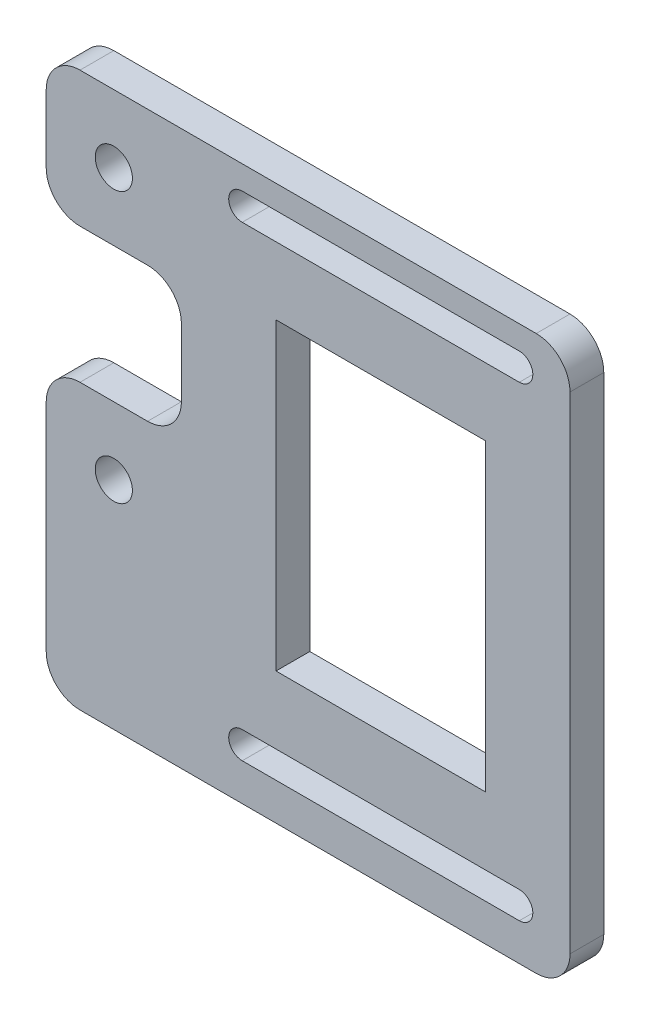
ISO-10303-21;
HEADER;
FILE_DESCRIPTION(('STEP AP214'),'2;1');
FILE_NAME('part.step','',(''),(''),'','','');
FILE_SCHEMA(('AUTOMOTIVE_DESIGN { 1 0 10303 214 1 1 1 1 }'));
ENDSEC;
DATA;
#1=APPLICATION_CONTEXT('core data for automotive mechanical design processes');
#2=APPLICATION_PROTOCOL_DEFINITION('international standard','automotive_design',2000,#1);
#3=PRODUCT_CONTEXT('',#1,'mechanical');
#4=PRODUCT('Part','Part','',(#3));
#5=PRODUCT_RELATED_PRODUCT_CATEGORY('part','',(#4));
#6=PRODUCT_DEFINITION_FORMATION('','',#4);
#7=PRODUCT_DEFINITION_CONTEXT('part definition',#1,'design');
#8=PRODUCT_DEFINITION('design','',#6,#7);
#9=PRODUCT_DEFINITION_SHAPE('','',#8);
#10=(LENGTH_UNIT() NAMED_UNIT(*) SI_UNIT(.MILLI.,.METRE.));
#11=(NAMED_UNIT(*) PLANE_ANGLE_UNIT() SI_UNIT($,.RADIAN.));
#12=(NAMED_UNIT(*) SI_UNIT($,.STERADIAN.) SOLID_ANGLE_UNIT());
#13=UNCERTAINTY_MEASURE_WITH_UNIT(LENGTH_MEASURE(1.E-05),#10,'distance_accuracy_value','');
#14=(GEOMETRIC_REPRESENTATION_CONTEXT(3) GLOBAL_UNCERTAINTY_ASSIGNED_CONTEXT((#13)) GLOBAL_UNIT_ASSIGNED_CONTEXT((#10,
#11,#12)) REPRESENTATION_CONTEXT('',''));
#15=CARTESIAN_POINT('',(0.,0.,0.));
#16=DIRECTION('',(0.,0.,1.));
#17=DIRECTION('',(1.,0.,0.));
#18=AXIS2_PLACEMENT_3D('',#15,#16,#17);
#19=CARTESIAN_POINT('',(0.,0.,5.));
#20=DIRECTION('',(0.,0.,1.));
#21=DIRECTION('',(1.,0.,0.));
#22=AXIS2_PLACEMENT_3D('',#19,#20,#21);
#23=PLANE('',#22);
#24=CARTESIAN_POINT('',(0.,20.,5.));
#25=DIRECTION('',(0.,0.,1.));
#26=DIRECTION('',(1.,0.,0.));
#27=AXIS2_PLACEMENT_3D('',#24,#25,#26);
#28=CIRCLE('',#27,2.75);
#29=CARTESIAN_POINT('',(2.75,20.,5.));
#30=VERTEX_POINT('',#29);
#31=EDGE_CURVE('E819',#30,#30,#28,.T.);
#32=ORIENTED_EDGE('',*,*,#31,.F.);
#33=EDGE_LOOP('',(#32));
#34=FACE_BOUND('',#33,.T.);
#35=CARTESIAN_POINT('',(0.,-20.,5.));
#36=DIRECTION('',(0.,0.,1.));
#37=DIRECTION('',(1.,0.,0.));
#38=AXIS2_PLACEMENT_3D('',#35,#36,#37);
#39=CIRCLE('',#38,2.75);
#40=CARTESIAN_POINT('',(2.75,-20.,5.));
#41=VERTEX_POINT('',#40);
#42=EDGE_CURVE('E815',#41,#41,#39,.T.);
#43=ORIENTED_EDGE('',*,*,#42,.F.);
#44=EDGE_LOOP('',(#43));
#45=FACE_BOUND('',#44,.T.);
#46=DIRECTION('',(0.,1.,0.));
#47=VECTOR('',#46,1.);
#48=CARTESIAN_POINT('',(67.5,-51.9999999999999,5.));
#49=LINE('',#48,#47);
#50=CARTESIAN_POINT('',(67.5,-46.9999999999999,5.));
#51=VERTEX_POINT('',#50);
#52=CARTESIAN_POINT('',(67.5,25.,5.));
#53=VERTEX_POINT('',#52);
#54=EDGE_CURVE('E345',#51,#53,#49,.T.);
#55=ORIENTED_EDGE('',*,*,#54,.T.);
#56=CARTESIAN_POINT('',(62.5,25.,5.));
#57=DIRECTION('',(0.,0.,1.));
#58=DIRECTION('',(1.,0.,0.));
#59=AXIS2_PLACEMENT_3D('',#56,#57,#58);
#60=CIRCLE('',#59,5.);
#61=CARTESIAN_POINT('',(62.5,30.,5.));
#62=VERTEX_POINT('',#61);
#63=EDGE_CURVE('E400',#53,#62,#60,.T.);
#64=ORIENTED_EDGE('',*,*,#63,.T.);
#65=DIRECTION('',(-1.,0.,0.));
#66=VECTOR('',#65,1.);
#67=CARTESIAN_POINT('',(67.5,30.,5.));
#68=LINE('',#67,#66);
#69=CARTESIAN_POINT('',(-5.,30.,5.));
#70=VERTEX_POINT('',#69);
#71=EDGE_CURVE('E325',#62,#70,#68,.T.);
#72=ORIENTED_EDGE('',*,*,#71,.T.);
#73=CARTESIAN_POINT('',(-5.,25.,5.));
#74=DIRECTION('',(0.,0.,1.));
#75=DIRECTION('',(1.,0.,0.));
#76=AXIS2_PLACEMENT_3D('',#73,#74,#75);
#77=CIRCLE('',#76,5.);
#78=CARTESIAN_POINT('',(-10.,25.,5.));
#79=VERTEX_POINT('',#78);
#80=EDGE_CURVE('E391',#70,#79,#77,.T.);
#81=ORIENTED_EDGE('',*,*,#80,.T.);
#82=DIRECTION('',(0.,-1.,0.));
#83=VECTOR('',#82,1.);
#84=CARTESIAN_POINT('',(-10.,30.,5.));
#85=LINE('',#84,#83);
#86=CARTESIAN_POINT('',(-10.,15.,5.));
#87=VERTEX_POINT('',#86);
#88=EDGE_CURVE('E328',#79,#87,#85,.T.);
#89=ORIENTED_EDGE('',*,*,#88,.T.);
#90=CARTESIAN_POINT('',(-5.,15.,5.));
#91=DIRECTION('',(0.,0.,1.));
#92=DIRECTION('',(1.,0.,0.));
#93=AXIS2_PLACEMENT_3D('',#90,#91,#92);
#94=CIRCLE('',#93,5.);
#95=CARTESIAN_POINT('',(-5.,10.,5.));
#96=VERTEX_POINT('',#95);
#97=EDGE_CURVE('E393',#87,#96,#94,.T.);
#98=ORIENTED_EDGE('',*,*,#97,.T.);
#99=DIRECTION('',(1.,0.,0.));
#100=VECTOR('',#99,1.);
#101=CARTESIAN_POINT('',(-10.,10.,5.));
#102=LINE('',#101,#100);
#103=CARTESIAN_POINT('',(5.,10.,5.));
#104=VERTEX_POINT('',#103);
#105=EDGE_CURVE('E332',#96,#104,#102,.T.);
#106=ORIENTED_EDGE('',*,*,#105,.T.);
#107=CARTESIAN_POINT('',(5.,5.,5.));
#108=DIRECTION('',(0.,0.,1.));
#109=DIRECTION('',(1.,0.,0.));
#110=AXIS2_PLACEMENT_3D('',#107,#108,#109);
#111=CIRCLE('',#110,5.);
#112=CARTESIAN_POINT('',(10.,5.,5.));
#113=VERTEX_POINT('',#112);
#114=EDGE_CURVE('E11',#104,#113,#111,.F.);
#115=ORIENTED_EDGE('',*,*,#114,.T.);
#116=DIRECTION('',(0.,-1.,0.));
#117=VECTOR('',#116,1.);
#118=CARTESIAN_POINT('',(10.,10.,5.));
#119=LINE('',#118,#117);
#120=CARTESIAN_POINT('',(10.,-5.,5.));
#121=VERTEX_POINT('',#120);
#122=EDGE_CURVE('E335',#113,#121,#119,.T.);
#123=ORIENTED_EDGE('',*,*,#122,.T.);
#124=CARTESIAN_POINT('',(5.,-5.,5.));
#125=DIRECTION('',(0.,0.,1.));
#126=DIRECTION('',(1.,0.,0.));
#127=AXIS2_PLACEMENT_3D('',#124,#125,#126);
#128=CIRCLE('',#127,5.);
#129=CARTESIAN_POINT('',(5.,-10.,5.));
#130=VERTEX_POINT('',#129);
#131=EDGE_CURVE('E433',#121,#130,#128,.F.);
#132=ORIENTED_EDGE('',*,*,#131,.T.);
#133=DIRECTION('',(-1.,0.,0.));
#134=VECTOR('',#133,1.);
#135=CARTESIAN_POINT('',(10.,-10.,5.));
#136=LINE('',#135,#134);
#137=CARTESIAN_POINT('',(-5.,-10.,5.));
#138=VERTEX_POINT('',#137);
#139=EDGE_CURVE('E338',#130,#138,#136,.T.);
#140=ORIENTED_EDGE('',*,*,#139,.T.);
#141=CARTESIAN_POINT('',(-5.,-15.,5.));
#142=DIRECTION('',(0.,0.,1.));
#143=DIRECTION('',(1.,0.,0.));
#144=AXIS2_PLACEMENT_3D('',#141,#142,#143);
#145=CIRCLE('',#144,5.);
#146=CARTESIAN_POINT('',(-10.,-15.,5.));
#147=VERTEX_POINT('',#146);
#148=EDGE_CURVE('E395',#138,#147,#145,.T.);
#149=ORIENTED_EDGE('',*,*,#148,.T.);
#150=DIRECTION('',(0.,-1.,0.));
#151=VECTOR('',#150,1.);
#152=CARTESIAN_POINT('',(-10.,-10.,5.));
#153=LINE('',#152,#151);
#154=CARTESIAN_POINT('',(-9.99999999999999,-46.9999999999999,5.));
#155=VERTEX_POINT('',#154);
#156=EDGE_CURVE('E341',#147,#155,#153,.T.);
#157=ORIENTED_EDGE('',*,*,#156,.T.);
#158=CARTESIAN_POINT('',(-4.99999999999999,-46.9999999999999,5.));
#159=DIRECTION('',(0.,0.,1.));
#160=DIRECTION('',(1.,0.,0.));
#161=AXIS2_PLACEMENT_3D('',#158,#159,#160);
#162=CIRCLE('',#161,5.);
#163=CARTESIAN_POINT('',(-4.99999999999999,-51.9999999999999,5.));
#164=VERTEX_POINT('',#163);
#165=EDGE_CURVE('E55',#155,#164,#162,.T.);
#166=ORIENTED_EDGE('',*,*,#165,.T.);
#167=DIRECTION('',(1.,0.,0.));
#168=VECTOR('',#167,1.);
#169=CARTESIAN_POINT('',(-9.99999999999999,-51.9999999999999,5.));
#170=LINE('',#169,#168);
#171=CARTESIAN_POINT('',(62.5,-51.9999999999999,5.));
#172=VERTEX_POINT('',#171);
#173=EDGE_CURVE('E343',#164,#172,#170,.T.);
#174=ORIENTED_EDGE('',*,*,#173,.T.);
#175=CARTESIAN_POINT('',(62.5,-46.9999999999999,5.));
#176=DIRECTION('',(0.,0.,1.));
#177=DIRECTION('',(1.,0.,0.));
#178=AXIS2_PLACEMENT_3D('',#175,#176,#177);
#179=CIRCLE('',#178,5.);
#180=EDGE_CURVE('E398',#172,#51,#179,.T.);
#181=ORIENTED_EDGE('',*,*,#180,.T.);
#182=EDGE_LOOP('',(#55,#64,#72,#81,#89,#98,#106,#115,#123,#132,#140,#149,#157,#166,#174,#181));
#183=FACE_BOUND('',#182,.T.);
#184=DIRECTION('',(1.,0.,0.));
#185=VECTOR('',#184,1.);
#186=CARTESIAN_POINT('',(19.,22.5,5.));
#187=LINE('',#186,#185);
#188=CARTESIAN_POINT('',(19.,22.5,5.));
#189=VERTEX_POINT('',#188);
#190=CARTESIAN_POINT('',(60.,22.4999999999999,5.));
#191=VERTEX_POINT('',#190);
#192=EDGE_CURVE('E296',#189,#191,#187,.T.);
#193=ORIENTED_EDGE('',*,*,#192,.F.);
#194=CARTESIAN_POINT('',(19.,24.4999999999999,5.));
#195=DIRECTION('',(0.,0.,1.));
#196=DIRECTION('',(1.,0.,0.));
#197=AXIS2_PLACEMENT_3D('',#194,#195,#196);
#198=CIRCLE('',#197,1.99999999999995);
#199=CARTESIAN_POINT('',(19.,26.4999999999999,5.));
#200=VERTEX_POINT('',#199);
#201=EDGE_CURVE('E294',#200,#189,#198,.T.);
#202=ORIENTED_EDGE('',*,*,#201,.F.);
#203=DIRECTION('',(-1.,0.,0.));
#204=VECTOR('',#203,1.);
#205=CARTESIAN_POINT('',(19.,26.4999999999999,5.));
#206=LINE('',#205,#204);
#207=CARTESIAN_POINT('',(60.,26.4999999999999,5.));
#208=VERTEX_POINT('',#207);
#209=EDGE_CURVE('E302',#208,#200,#206,.T.);
#210=ORIENTED_EDGE('',*,*,#209,.F.);
#211=CARTESIAN_POINT('',(60.,24.4999999999999,5.));
#212=DIRECTION('',(0.,0.,1.));
#213=DIRECTION('',(1.,0.,0.));
#214=AXIS2_PLACEMENT_3D('',#211,#212,#213);
#215=CIRCLE('',#214,1.99999999999995);
#216=EDGE_CURVE('E299',#191,#208,#215,.T.);
#217=ORIENTED_EDGE('',*,*,#216,.F.);
#218=EDGE_LOOP('',(#193,#202,#210,#217));
#219=FACE_BOUND('',#218,.T.);
#220=DIRECTION('',(1.,0.,0.));
#221=VECTOR('',#220,1.);
#222=CARTESIAN_POINT('',(19.,-46.4999999999999,5.));
#223=LINE('',#222,#221);
#224=CARTESIAN_POINT('',(19.,-46.4999999999999,5.));
#225=VERTEX_POINT('',#224);
#226=CARTESIAN_POINT('',(60.,-46.4999999999999,5.));
#227=VERTEX_POINT('',#226);
#228=EDGE_CURVE('E265',#225,#227,#223,.T.);
#229=ORIENTED_EDGE('',*,*,#228,.F.);
#230=CARTESIAN_POINT('',(19.,-44.4999999999999,5.));
#231=DIRECTION('',(0.,0.,1.));
#232=DIRECTION('',(1.,0.,0.));
#233=AXIS2_PLACEMENT_3D('',#230,#231,#232);
#234=CIRCLE('',#233,1.99999999999995);
#235=CARTESIAN_POINT('',(19.,-42.5,5.));
#236=VERTEX_POINT('',#235);
#237=EDGE_CURVE('E263',#236,#225,#234,.T.);
#238=ORIENTED_EDGE('',*,*,#237,.F.);
#239=DIRECTION('',(-1.,0.,0.));
#240=VECTOR('',#239,1.);
#241=CARTESIAN_POINT('',(19.,-42.5,5.));
#242=LINE('',#241,#240);
#243=CARTESIAN_POINT('',(60.,-42.5,5.));
#244=VERTEX_POINT('',#243);
#245=EDGE_CURVE('E271',#244,#236,#242,.T.);
#246=ORIENTED_EDGE('',*,*,#245,.F.);
#247=CARTESIAN_POINT('',(60.,-44.4999999999999,5.));
#248=DIRECTION('',(0.,0.,1.));
#249=DIRECTION('',(1.,0.,0.));
#250=AXIS2_PLACEMENT_3D('',#247,#248,#249);
#251=CIRCLE('',#250,1.99999999999995);
#252=EDGE_CURVE('E268',#227,#244,#251,.T.);
#253=ORIENTED_EDGE('',*,*,#252,.F.);
#254=EDGE_LOOP('',(#229,#238,#246,#253));
#255=FACE_BOUND('',#254,.T.);
#256=DIRECTION('',(1.,0.,0.));
#257=VECTOR('',#256,1.);
#258=CARTESIAN_POINT('',(24.,-32.5,5.));
#259=LINE('',#258,#257);
#260=CARTESIAN_POINT('',(24.,-32.5,5.));
#261=VERTEX_POINT('',#260);
#262=CARTESIAN_POINT('',(55.,-32.5,5.));
#263=VERTEX_POINT('',#262);
#264=EDGE_CURVE('E230',#261,#263,#259,.T.);
#265=ORIENTED_EDGE('',*,*,#264,.F.);
#266=DIRECTION('',(0.,-1.,0.));
#267=VECTOR('',#266,1.);
#268=CARTESIAN_POINT('',(24.,12.5,5.));
#269=LINE('',#268,#267);
#270=CARTESIAN_POINT('',(24.,12.5,5.));
#271=VERTEX_POINT('',#270);
#272=EDGE_CURVE('E220',#271,#261,#269,.T.);
#273=ORIENTED_EDGE('',*,*,#272,.F.);
#274=DIRECTION('',(-1.,0.,0.));
#275=VECTOR('',#274,1.);
#276=CARTESIAN_POINT('',(24.,12.5,5.));
#277=LINE('',#276,#275);
#278=CARTESIAN_POINT('',(55.,12.5,5.));
#279=VERTEX_POINT('',#278);
#280=EDGE_CURVE('E245',#279,#271,#277,.T.);
#281=ORIENTED_EDGE('',*,*,#280,.F.);
#282=DIRECTION('',(0.,1.,0.));
#283=VECTOR('',#282,1.);
#284=CARTESIAN_POINT('',(55.,12.5,5.));
#285=LINE('',#284,#283);
#286=EDGE_CURVE('E243',#263,#279,#285,.T.);
#287=ORIENTED_EDGE('',*,*,#286,.F.);
#288=EDGE_LOOP('',(#265,#273,#281,#287));
#289=FACE_BOUND('',#288,.T.);
#290=ADVANCED_FACE('F33',(#34,#45,#183,#219,#255,#289),#23,.T.);
#291=CARTESIAN_POINT('',(0.,0.,0.));
#292=DIRECTION('',(0.,0.,1.));
#293=DIRECTION('',(1.,0.,0.));
#294=AXIS2_PLACEMENT_3D('',#291,#292,#293);
#295=PLANE('',#294);
#296=CARTESIAN_POINT('',(0.,20.,0.));
#297=DIRECTION('',(0.,0.,1.));
#298=DIRECTION('',(1.,0.,0.));
#299=AXIS2_PLACEMENT_3D('',#296,#297,#298);
#300=CIRCLE('',#299,2.75);
#301=CARTESIAN_POINT('',(2.75,20.,0.));
#302=VERTEX_POINT('',#301);
#303=EDGE_CURVE('E816',#302,#302,#300,.T.);
#304=ORIENTED_EDGE('',*,*,#303,.T.);
#305=EDGE_LOOP('',(#304));
#306=FACE_BOUND('',#305,.T.);
#307=CARTESIAN_POINT('',(0.,-20.,0.));
#308=DIRECTION('',(0.,0.,1.));
#309=DIRECTION('',(1.,0.,0.));
#310=AXIS2_PLACEMENT_3D('',#307,#308,#309);
#311=CIRCLE('',#310,2.75);
#312=CARTESIAN_POINT('',(2.75,-20.,0.));
#313=VERTEX_POINT('',#312);
#314=EDGE_CURVE('E252',#313,#313,#311,.T.);
#315=ORIENTED_EDGE('',*,*,#314,.T.);
#316=EDGE_LOOP('',(#315));
#317=FACE_BOUND('',#316,.T.);
#318=CARTESIAN_POINT('',(19.,-44.4999999999999,0.));
#319=DIRECTION('',(0.,0.,1.));
#320=DIRECTION('',(1.,0.,0.));
#321=AXIS2_PLACEMENT_3D('',#318,#319,#320);
#322=CIRCLE('',#321,1.99999999999995);
#323=CARTESIAN_POINT('',(19.,-42.5,0.));
#324=VERTEX_POINT('',#323);
#325=CARTESIAN_POINT('',(19.,-46.4999999999999,0.));
#326=VERTEX_POINT('',#325);
#327=EDGE_CURVE('E238',#324,#326,#322,.T.);
#328=ORIENTED_EDGE('',*,*,#327,.T.);
#329=DIRECTION('',(1.,0.,0.));
#330=VECTOR('',#329,1.);
#331=CARTESIAN_POINT('',(19.,-46.4999999999999,0.));
#332=LINE('',#331,#330);
#333=CARTESIAN_POINT('',(60.,-46.4999999999999,0.));
#334=VERTEX_POINT('',#333);
#335=EDGE_CURVE('E276',#326,#334,#332,.T.);
#336=ORIENTED_EDGE('',*,*,#335,.T.);
#337=CARTESIAN_POINT('',(60.,-44.4999999999999,0.));
#338=DIRECTION('',(0.,0.,1.));
#339=DIRECTION('',(1.,0.,0.));
#340=AXIS2_PLACEMENT_3D('',#337,#338,#339);
#341=CIRCLE('',#340,1.99999999999995);
#342=CARTESIAN_POINT('',(60.,-42.5,0.));
#343=VERTEX_POINT('',#342);
#344=EDGE_CURVE('E279',#334,#343,#341,.T.);
#345=ORIENTED_EDGE('',*,*,#344,.T.);
#346=DIRECTION('',(-1.,0.,0.));
#347=VECTOR('',#346,1.);
#348=CARTESIAN_POINT('',(19.,-42.5,0.));
#349=LINE('',#348,#347);
#350=EDGE_CURVE('E266',#343,#324,#349,.T.);
#351=ORIENTED_EDGE('',*,*,#350,.T.);
#352=EDGE_LOOP('',(#328,#336,#345,#351));
#353=FACE_BOUND('',#352,.T.);
#354=DIRECTION('',(-1.,0.,0.));
#355=VECTOR('',#354,1.);
#356=CARTESIAN_POINT('',(67.5,30.,0.));
#357=LINE('',#356,#355);
#358=CARTESIAN_POINT('',(62.5,30.,0.));
#359=VERTEX_POINT('',#358);
#360=CARTESIAN_POINT('',(-5.,30.,0.));
#361=VERTEX_POINT('',#360);
#362=EDGE_CURVE('E324',#359,#361,#357,.T.);
#363=ORIENTED_EDGE('',*,*,#362,.F.);
#364=CARTESIAN_POINT('',(62.5,25.,0.));
#365=DIRECTION('',(0.,0.,1.));
#366=DIRECTION('',(1.,0.,0.));
#367=AXIS2_PLACEMENT_3D('',#364,#365,#366);
#368=CIRCLE('',#367,5.);
#369=CARTESIAN_POINT('',(67.5,25.,0.));
#370=VERTEX_POINT('',#369);
#371=EDGE_CURVE('E384',#359,#370,#368,.F.);
#372=ORIENTED_EDGE('',*,*,#371,.T.);
#373=DIRECTION('',(0.,1.,0.));
#374=VECTOR('',#373,1.);
#375=CARTESIAN_POINT('',(67.5,-51.9999999999999,0.));
#376=LINE('',#375,#374);
#377=CARTESIAN_POINT('',(67.5,-46.9999999999999,0.));
#378=VERTEX_POINT('',#377);
#379=EDGE_CURVE('E329',#378,#370,#376,.T.);
#380=ORIENTED_EDGE('',*,*,#379,.F.);
#381=CARTESIAN_POINT('',(62.5,-46.9999999999999,0.));
#382=DIRECTION('',(0.,0.,1.));
#383=DIRECTION('',(1.,0.,0.));
#384=AXIS2_PLACEMENT_3D('',#381,#382,#383);
#385=CIRCLE('',#384,5.);
#386=CARTESIAN_POINT('',(62.5,-51.9999999999999,0.));
#387=VERTEX_POINT('',#386);
#388=EDGE_CURVE('E382',#378,#387,#385,.F.);
#389=ORIENTED_EDGE('',*,*,#388,.T.);
#390=DIRECTION('',(1.,0.,0.));
#391=VECTOR('',#390,1.);
#392=CARTESIAN_POINT('',(-9.99999999999999,-51.9999999999999,0.));
#393=LINE('',#392,#391);
#394=CARTESIAN_POINT('',(-4.99999999999999,-51.9999999999999,0.));
#395=VERTEX_POINT('',#394);
#396=EDGE_CURVE('E366',#395,#387,#393,.T.);
#397=ORIENTED_EDGE('',*,*,#396,.F.);
#398=CARTESIAN_POINT('',(-4.99999999999999,-46.9999999999999,0.));
#399=DIRECTION('',(0.,0.,1.));
#400=DIRECTION('',(1.,0.,0.));
#401=AXIS2_PLACEMENT_3D('',#398,#399,#400);
#402=CIRCLE('',#401,5.);
#403=CARTESIAN_POINT('',(-9.99999999999999,-46.9999999999999,0.));
#404=VERTEX_POINT('',#403);
#405=EDGE_CURVE('E380',#395,#404,#402,.F.);
#406=ORIENTED_EDGE('',*,*,#405,.T.);
#407=DIRECTION('',(0.,-1.,0.));
#408=VECTOR('',#407,1.);
#409=CARTESIAN_POINT('',(-10.,-10.,0.));
#410=LINE('',#409,#408);
#411=CARTESIAN_POINT('',(-10.,-15.,0.));
#412=VERTEX_POINT('',#411);
#413=EDGE_CURVE('E363',#412,#404,#410,.T.);
#414=ORIENTED_EDGE('',*,*,#413,.F.);
#415=CARTESIAN_POINT('',(-5.,-15.,0.));
#416=DIRECTION('',(0.,0.,1.));
#417=DIRECTION('',(1.,0.,0.));
#418=AXIS2_PLACEMENT_3D('',#415,#416,#417);
#419=CIRCLE('',#418,5.);
#420=CARTESIAN_POINT('',(-5.,-10.,0.));
#421=VERTEX_POINT('',#420);
#422=EDGE_CURVE('E378',#412,#421,#419,.F.);
#423=ORIENTED_EDGE('',*,*,#422,.T.);
#424=DIRECTION('',(-1.,0.,0.));
#425=VECTOR('',#424,1.);
#426=CARTESIAN_POINT('',(10.,-10.,0.));
#427=LINE('',#426,#425);
#428=CARTESIAN_POINT('',(5.,-10.,0.));
#429=VERTEX_POINT('',#428);
#430=EDGE_CURVE('E360',#429,#421,#427,.T.);
#431=ORIENTED_EDGE('',*,*,#430,.F.);
#432=CARTESIAN_POINT('',(5.,-5.,0.));
#433=DIRECTION('',(0.,0.,1.));
#434=DIRECTION('',(1.,0.,0.));
#435=AXIS2_PLACEMENT_3D('',#432,#433,#434);
#436=CIRCLE('',#435,5.);
#437=CARTESIAN_POINT('',(10.,-5.,0.));
#438=VERTEX_POINT('',#437);
#439=EDGE_CURVE('E431',#429,#438,#436,.T.);
#440=ORIENTED_EDGE('',*,*,#439,.T.);
#441=DIRECTION('',(0.,-1.,0.));
#442=VECTOR('',#441,1.);
#443=CARTESIAN_POINT('',(10.,10.,0.));
#444=LINE('',#443,#442);
#445=CARTESIAN_POINT('',(10.,5.,0.));
#446=VERTEX_POINT('',#445);
#447=EDGE_CURVE('E357',#446,#438,#444,.T.);
#448=ORIENTED_EDGE('',*,*,#447,.F.);
#449=CARTESIAN_POINT('',(5.,5.,0.));
#450=DIRECTION('',(0.,0.,1.));
#451=DIRECTION('',(1.,0.,0.));
#452=AXIS2_PLACEMENT_3D('',#449,#450,#451);
#453=CIRCLE('',#452,5.);
#454=CARTESIAN_POINT('',(5.,10.,0.));
#455=VERTEX_POINT('',#454);
#456=EDGE_CURVE('E41',#446,#455,#453,.T.);
#457=ORIENTED_EDGE('',*,*,#456,.T.);
#458=DIRECTION('',(1.,0.,0.));
#459=VECTOR('',#458,1.);
#460=CARTESIAN_POINT('',(-10.,10.,0.));
#461=LINE('',#460,#459);
#462=CARTESIAN_POINT('',(-5.,10.,0.));
#463=VERTEX_POINT('',#462);
#464=EDGE_CURVE('E354',#463,#455,#461,.T.);
#465=ORIENTED_EDGE('',*,*,#464,.F.);
#466=CARTESIAN_POINT('',(-5.,15.,0.));
#467=DIRECTION('',(0.,0.,1.));
#468=DIRECTION('',(1.,0.,0.));
#469=AXIS2_PLACEMENT_3D('',#466,#467,#468);
#470=CIRCLE('',#469,5.);
#471=CARTESIAN_POINT('',(-10.,15.,0.));
#472=VERTEX_POINT('',#471);
#473=EDGE_CURVE('E376',#463,#472,#470,.F.);
#474=ORIENTED_EDGE('',*,*,#473,.T.);
#475=DIRECTION('',(0.,-1.,0.));
#476=VECTOR('',#475,1.);
#477=CARTESIAN_POINT('',(-10.,30.,0.));
#478=LINE('',#477,#476);
#479=CARTESIAN_POINT('',(-10.,25.,0.));
#480=VERTEX_POINT('',#479);
#481=EDGE_CURVE('E351',#480,#472,#478,.T.);
#482=ORIENTED_EDGE('',*,*,#481,.F.);
#483=CARTESIAN_POINT('',(-5.,25.,0.));
#484=DIRECTION('',(0.,0.,1.));
#485=DIRECTION('',(1.,0.,0.));
#486=AXIS2_PLACEMENT_3D('',#483,#484,#485);
#487=CIRCLE('',#486,5.);
#488=EDGE_CURVE('E374',#480,#361,#487,.F.);
#489=ORIENTED_EDGE('',*,*,#488,.T.);
#490=EDGE_LOOP('',(#363,#372,#380,#389,#397,#406,#414,#423,#431,#440,#448,#457,#465,#474,#482,#489));
#491=FACE_BOUND('',#490,.T.);
#492=CARTESIAN_POINT('',(19.,24.4999999999999,0.));
#493=DIRECTION('',(0.,0.,1.));
#494=DIRECTION('',(1.,0.,0.));
#495=AXIS2_PLACEMENT_3D('',#492,#493,#494);
#496=CIRCLE('',#495,1.99999999999995);
#497=CARTESIAN_POINT('',(19.,26.4999999999999,0.));
#498=VERTEX_POINT('',#497);
#499=CARTESIAN_POINT('',(19.,22.5,0.));
#500=VERTEX_POINT('',#499);
#501=EDGE_CURVE('E293',#498,#500,#496,.T.);
#502=ORIENTED_EDGE('',*,*,#501,.T.);
#503=DIRECTION('',(1.,0.,0.));
#504=VECTOR('',#503,1.);
#505=CARTESIAN_POINT('',(19.,22.5,0.));
#506=LINE('',#505,#504);
#507=CARTESIAN_POINT('',(60.,22.4999999999999,0.));
#508=VERTEX_POINT('',#507);
#509=EDGE_CURVE('E307',#500,#508,#506,.T.);
#510=ORIENTED_EDGE('',*,*,#509,.T.);
#511=CARTESIAN_POINT('',(60.,24.4999999999999,0.));
#512=DIRECTION('',(0.,0.,1.));
#513=DIRECTION('',(1.,0.,0.));
#514=AXIS2_PLACEMENT_3D('',#511,#512,#513);
#515=CIRCLE('',#514,1.99999999999995);
#516=CARTESIAN_POINT('',(60.,26.4999999999999,0.));
#517=VERTEX_POINT('',#516);
#518=EDGE_CURVE('E310',#508,#517,#515,.T.);
#519=ORIENTED_EDGE('',*,*,#518,.T.);
#520=DIRECTION('',(-1.,0.,0.));
#521=VECTOR('',#520,1.);
#522=CARTESIAN_POINT('',(19.,26.4999999999999,0.));
#523=LINE('',#522,#521);
#524=EDGE_CURVE('E297',#517,#498,#523,.T.);
#525=ORIENTED_EDGE('',*,*,#524,.T.);
#526=EDGE_LOOP('',(#502,#510,#519,#525));
#527=FACE_BOUND('',#526,.T.);
#528=DIRECTION('',(0.,-1.,0.));
#529=VECTOR('',#528,1.);
#530=CARTESIAN_POINT('',(24.,12.5,0.));
#531=LINE('',#530,#529);
#532=CARTESIAN_POINT('',(24.,12.5,0.));
#533=VERTEX_POINT('',#532);
#534=CARTESIAN_POINT('',(24.,-32.5,0.));
#535=VERTEX_POINT('',#534);
#536=EDGE_CURVE('E250',#533,#535,#531,.T.);
#537=ORIENTED_EDGE('',*,*,#536,.T.);
#538=DIRECTION('',(1.,0.,0.));
#539=VECTOR('',#538,1.);
#540=CARTESIAN_POINT('',(24.,-32.5,0.));
#541=LINE('',#540,#539);
#542=CARTESIAN_POINT('',(55.,-32.5,0.));
#543=VERTEX_POINT('',#542);
#544=EDGE_CURVE('E237',#535,#543,#541,.T.);
#545=ORIENTED_EDGE('',*,*,#544,.T.);
#546=DIRECTION('',(0.,1.,0.));
#547=VECTOR('',#546,1.);
#548=CARTESIAN_POINT('',(55.,12.5,0.));
#549=LINE('',#548,#547);
#550=CARTESIAN_POINT('',(55.,12.5,0.));
#551=VERTEX_POINT('',#550);
#552=EDGE_CURVE('E254',#543,#551,#549,.T.);
#553=ORIENTED_EDGE('',*,*,#552,.T.);
#554=DIRECTION('',(-1.,0.,0.));
#555=VECTOR('',#554,1.);
#556=CARTESIAN_POINT('',(24.,12.5,0.));
#557=LINE('',#556,#555);
#558=EDGE_CURVE('E231',#551,#533,#557,.T.);
#559=ORIENTED_EDGE('',*,*,#558,.T.);
#560=EDGE_LOOP('',(#537,#545,#553,#559));
#561=FACE_BOUND('',#560,.T.);
#562=ADVANCED_FACE('F438',(#306,#317,#353,#491,#527,#561),#295,.F.);
#563=CARTESIAN_POINT('',(67.5,30.,5.));
#564=DIRECTION('',(0.,-1.,0.));
#565=DIRECTION('',(1.,0.,0.));
#566=AXIS2_PLACEMENT_3D('',#563,#564,#565);
#567=PLANE('',#566);
#568=ORIENTED_EDGE('',*,*,#71,.F.);
#569=DIRECTION('',(0.,0.,-1.));
#570=VECTOR('',#569,1.);
#571=CARTESIAN_POINT('',(62.5,30.,5.));
#572=LINE('',#571,#570);
#573=EDGE_CURVE('E371',#62,#359,#572,.T.);
#574=ORIENTED_EDGE('',*,*,#573,.T.);
#575=ORIENTED_EDGE('',*,*,#362,.T.);
#576=DIRECTION('',(0.,0.,-1.));
#577=VECTOR('',#576,1.);
#578=CARTESIAN_POINT('',(-5.,30.,5.));
#579=LINE('',#578,#577);
#580=EDGE_CURVE('E348',#361,#70,#579,.F.);
#581=ORIENTED_EDGE('',*,*,#580,.T.);
#582=EDGE_LOOP('',(#568,#574,#575,#581));
#583=FACE_BOUND('',#582,.T.);
#584=ADVANCED_FACE('F492',(#583),#567,.F.);
#585=CARTESIAN_POINT('',(-10.,30.,5.));
#586=DIRECTION('',(1.,0.,0.));
#587=DIRECTION('',(0.,0.,-1.));
#588=AXIS2_PLACEMENT_3D('',#585,#586,#587);
#589=PLANE('',#588);
#590=ORIENTED_EDGE('',*,*,#481,.T.);
#591=DIRECTION('',(0.,0.,-1.));
#592=VECTOR('',#591,1.);
#593=CARTESIAN_POINT('',(-10.,15.,5.));
#594=LINE('',#593,#592);
#595=EDGE_CURVE('E429',#472,#87,#594,.F.);
#596=ORIENTED_EDGE('',*,*,#595,.T.);
#597=ORIENTED_EDGE('',*,*,#88,.F.);
#598=DIRECTION('',(0.,0.,-1.));
#599=VECTOR('',#598,1.);
#600=CARTESIAN_POINT('',(-10.,25.,5.));
#601=LINE('',#600,#599);
#602=EDGE_CURVE('E426',#79,#480,#601,.T.);
#603=ORIENTED_EDGE('',*,*,#602,.T.);
#604=EDGE_LOOP('',(#590,#596,#597,#603));
#605=FACE_BOUND('',#604,.T.);
#606=ADVANCED_FACE('F500',(#605),#589,.F.);
#607=CARTESIAN_POINT('',(-10.,10.,5.));
#608=DIRECTION('',(0.,1.,0.));
#609=DIRECTION('',(0.,0.,1.));
#610=AXIS2_PLACEMENT_3D('',#607,#608,#609);
#611=PLANE('',#610);
#612=ORIENTED_EDGE('',*,*,#464,.T.);
#613=DIRECTION('',(0.,0.,-1.));
#614=VECTOR('',#613,1.);
#615=CARTESIAN_POINT('',(5.,10.,5.));
#616=LINE('',#615,#614);
#617=EDGE_CURVE('E424',#455,#104,#616,.F.);
#618=ORIENTED_EDGE('',*,*,#617,.T.);
#619=ORIENTED_EDGE('',*,*,#105,.F.);
#620=DIRECTION('',(0.,0.,-1.));
#621=VECTOR('',#620,1.);
#622=CARTESIAN_POINT('',(-5.,10.,5.));
#623=LINE('',#622,#621);
#624=EDGE_CURVE('E421',#96,#463,#623,.T.);
#625=ORIENTED_EDGE('',*,*,#624,.T.);
#626=EDGE_LOOP('',(#612,#618,#619,#625));
#627=FACE_BOUND('',#626,.T.);
#628=ADVANCED_FACE('F444',(#627),#611,.F.);
#629=CARTESIAN_POINT('',(10.,10.,5.));
#630=DIRECTION('',(1.,0.,0.));
#631=DIRECTION('',(0.,0.,-1.));
#632=AXIS2_PLACEMENT_3D('',#629,#630,#631);
#633=PLANE('',#632);
#634=ORIENTED_EDGE('',*,*,#447,.T.);
#635=DIRECTION('',(0.,0.,-1.));
#636=VECTOR('',#635,1.);
#637=CARTESIAN_POINT('',(10.,-5.,5.));
#638=LINE('',#637,#636);
#639=EDGE_CURVE('E419',#438,#121,#638,.F.);
#640=ORIENTED_EDGE('',*,*,#639,.T.);
#641=ORIENTED_EDGE('',*,*,#122,.F.);
#642=DIRECTION('',(0.,0.,-1.));
#643=VECTOR('',#642,1.);
#644=CARTESIAN_POINT('',(10.,5.,0.));
#645=LINE('',#644,#643);
#646=EDGE_CURVE('E416',#113,#446,#645,.T.);
#647=ORIENTED_EDGE('',*,*,#646,.T.);
#648=EDGE_LOOP('',(#634,#640,#641,#647));
#649=FACE_BOUND('',#648,.T.);
#650=ADVANCED_FACE('F453',(#649),#633,.F.);
#651=CARTESIAN_POINT('',(10.,-10.,5.));
#652=DIRECTION('',(0.,-1.,0.));
#653=DIRECTION('',(0.,0.,-1.));
#654=AXIS2_PLACEMENT_3D('',#651,#652,#653);
#655=PLANE('',#654);
#656=ORIENTED_EDGE('',*,*,#430,.T.);
#657=DIRECTION('',(0.,0.,-1.));
#658=VECTOR('',#657,1.);
#659=CARTESIAN_POINT('',(-5.,-10.,5.));
#660=LINE('',#659,#658);
#661=EDGE_CURVE('E414',#421,#138,#660,.F.);
#662=ORIENTED_EDGE('',*,*,#661,.T.);
#663=ORIENTED_EDGE('',*,*,#139,.F.);
#664=DIRECTION('',(0.,0.,-1.));
#665=VECTOR('',#664,1.);
#666=CARTESIAN_POINT('',(5.,-10.,0.));
#667=LINE('',#666,#665);
#668=EDGE_CURVE('E411',#130,#429,#667,.T.);
#669=ORIENTED_EDGE('',*,*,#668,.T.);
#670=EDGE_LOOP('',(#656,#662,#663,#669));
#671=FACE_BOUND('',#670,.T.);
#672=ADVANCED_FACE('F461',(#671),#655,.F.);
#673=CARTESIAN_POINT('',(-10.,-10.,5.));
#674=DIRECTION('',(1.,0.,0.));
#675=DIRECTION('',(0.,1.,0.));
#676=AXIS2_PLACEMENT_3D('',#673,#674,#675);
#677=PLANE('',#676);
#678=ORIENTED_EDGE('',*,*,#413,.T.);
#679=DIRECTION('',(0.,0.,-1.));
#680=VECTOR('',#679,1.);
#681=CARTESIAN_POINT('',(-9.99999999999999,-46.9999999999999,5.));
#682=LINE('',#681,#680);
#683=EDGE_CURVE('E409',#404,#155,#682,.F.);
#684=ORIENTED_EDGE('',*,*,#683,.T.);
#685=ORIENTED_EDGE('',*,*,#156,.F.);
#686=DIRECTION('',(0.,0.,-1.));
#687=VECTOR('',#686,1.);
#688=CARTESIAN_POINT('',(-10.,-15.,5.));
#689=LINE('',#688,#687);
#690=EDGE_CURVE('E406',#147,#412,#689,.T.);
#691=ORIENTED_EDGE('',*,*,#690,.T.);
#692=EDGE_LOOP('',(#678,#684,#685,#691));
#693=FACE_BOUND('',#692,.T.);
#694=ADVANCED_FACE('F469',(#693),#677,.F.);
#695=CARTESIAN_POINT('',(-9.99999999999999,-51.9999999999999,5.));
#696=DIRECTION('',(0.,1.,0.));
#697=DIRECTION('',(0.,0.,1.));
#698=AXIS2_PLACEMENT_3D('',#695,#696,#697);
#699=PLANE('',#698);
#700=ORIENTED_EDGE('',*,*,#396,.T.);
#701=DIRECTION('',(0.,0.,-1.));
#702=VECTOR('',#701,1.);
#703=CARTESIAN_POINT('',(62.5,-51.9999999999999,5.));
#704=LINE('',#703,#702);
#705=EDGE_CURVE('E48',#387,#172,#704,.F.);
#706=ORIENTED_EDGE('',*,*,#705,.T.);
#707=ORIENTED_EDGE('',*,*,#173,.F.);
#708=DIRECTION('',(0.,0.,-1.));
#709=VECTOR('',#708,1.);
#710=CARTESIAN_POINT('',(-4.99999999999999,-51.9999999999999,5.));
#711=LINE('',#710,#709);
#712=EDGE_CURVE('E402',#164,#395,#711,.T.);
#713=ORIENTED_EDGE('',*,*,#712,.T.);
#714=EDGE_LOOP('',(#700,#706,#707,#713));
#715=FACE_BOUND('',#714,.T.);
#716=ADVANCED_FACE('F476',(#715),#699,.F.);
#717=CARTESIAN_POINT('',(67.5,-51.9999999999999,5.));
#718=DIRECTION('',(-1.,0.,0.));
#719=DIRECTION('',(0.,-1.,0.));
#720=AXIS2_PLACEMENT_3D('',#717,#718,#719);
#721=PLANE('',#720);
#722=ORIENTED_EDGE('',*,*,#379,.T.);
#723=DIRECTION('',(0.,0.,-1.));
#724=VECTOR('',#723,1.);
#725=CARTESIAN_POINT('',(67.5,25.,5.));
#726=LINE('',#725,#724);
#727=EDGE_CURVE('E389',#370,#53,#726,.F.);
#728=ORIENTED_EDGE('',*,*,#727,.T.);
#729=ORIENTED_EDGE('',*,*,#54,.F.);
#730=DIRECTION('',(0.,0.,-1.));
#731=VECTOR('',#730,1.);
#732=CARTESIAN_POINT('',(67.5,-46.9999999999999,5.));
#733=LINE('',#732,#731);
#734=EDGE_CURVE('E386',#51,#378,#733,.T.);
#735=ORIENTED_EDGE('',*,*,#734,.T.);
#736=EDGE_LOOP('',(#722,#728,#729,#735));
#737=FACE_BOUND('',#736,.T.);
#738=ADVANCED_FACE('F484',(#737),#721,.F.);
#739=CARTESIAN_POINT('',(19.,24.4999999999999,5.));
#740=DIRECTION('',(0.,0.,-1.));
#741=DIRECTION('',(-1.,0.,0.));
#742=AXIS2_PLACEMENT_3D('',#739,#740,#741);
#743=CYLINDRICAL_SURFACE('',#742,1.99999999999995);
#744=ORIENTED_EDGE('',*,*,#501,.F.);
#745=DIRECTION('',(0.,0.,-1.));
#746=VECTOR('',#745,1.);
#747=CARTESIAN_POINT('',(19.,26.4999999999999,5.));
#748=LINE('',#747,#746);
#749=EDGE_CURVE('E304',#200,#498,#748,.T.);
#750=ORIENTED_EDGE('',*,*,#749,.F.);
#751=ORIENTED_EDGE('',*,*,#201,.T.);
#752=DIRECTION('',(0.,0.,-1.));
#753=VECTOR('',#752,1.);
#754=CARTESIAN_POINT('',(19.,22.5,5.));
#755=LINE('',#754,#753);
#756=EDGE_CURVE('E321',#189,#500,#755,.T.);
#757=ORIENTED_EDGE('',*,*,#756,.T.);
#758=EDGE_LOOP('',(#744,#750,#751,#757));
#759=FACE_BOUND('',#758,.T.);
#760=ADVANCED_FACE('F522',(#759),#743,.F.);
#761=CARTESIAN_POINT('',(19.,22.5,5.));
#762=DIRECTION('',(0.,1.,0.));
#763=DIRECTION('',(0.,0.,1.));
#764=AXIS2_PLACEMENT_3D('',#761,#762,#763);
#765=PLANE('',#764);
#766=ORIENTED_EDGE('',*,*,#509,.F.);
#767=ORIENTED_EDGE('',*,*,#756,.F.);
#768=ORIENTED_EDGE('',*,*,#192,.T.);
#769=DIRECTION('',(0.,0.,-1.));
#770=VECTOR('',#769,1.);
#771=CARTESIAN_POINT('',(60.,22.4999999999999,5.));
#772=LINE('',#771,#770);
#773=EDGE_CURVE('E319',#191,#508,#772,.T.);
#774=ORIENTED_EDGE('',*,*,#773,.T.);
#775=EDGE_LOOP('',(#766,#767,#768,#774));
#776=FACE_BOUND('',#775,.T.);
#777=ADVANCED_FACE('F696',(#776),#765,.T.);
#778=CARTESIAN_POINT('',(60.,24.4999999999999,5.));
#779=DIRECTION('',(0.,0.,-1.));
#780=DIRECTION('',(-1.,0.,0.));
#781=AXIS2_PLACEMENT_3D('',#778,#779,#780);
#782=CYLINDRICAL_SURFACE('',#781,1.99999999999995);
#783=ORIENTED_EDGE('',*,*,#518,.F.);
#784=ORIENTED_EDGE('',*,*,#773,.F.);
#785=ORIENTED_EDGE('',*,*,#216,.T.);
#786=DIRECTION('',(0.,0.,-1.));
#787=VECTOR('',#786,1.);
#788=CARTESIAN_POINT('',(60.,26.4999999999999,5.));
#789=LINE('',#788,#787);
#790=EDGE_CURVE('E317',#208,#517,#789,.T.);
#791=ORIENTED_EDGE('',*,*,#790,.T.);
#792=EDGE_LOOP('',(#783,#784,#785,#791));
#793=FACE_BOUND('',#792,.T.);
#794=ADVANCED_FACE('F687',(#793),#782,.F.);
#795=CARTESIAN_POINT('',(19.,26.4999999999999,5.));
#796=DIRECTION('',(0.,-1.,0.));
#797=DIRECTION('',(0.,0.,-1.));
#798=AXIS2_PLACEMENT_3D('',#795,#796,#797);
#799=PLANE('',#798);
#800=ORIENTED_EDGE('',*,*,#524,.F.);
#801=ORIENTED_EDGE('',*,*,#790,.F.);
#802=ORIENTED_EDGE('',*,*,#209,.T.);
#803=ORIENTED_EDGE('',*,*,#749,.T.);
#804=EDGE_LOOP('',(#800,#801,#802,#803));
#805=FACE_BOUND('',#804,.T.);
#806=ADVANCED_FACE('F678',(#805),#799,.T.);
#807=CARTESIAN_POINT('',(19.,-44.4999999999999,5.));
#808=DIRECTION('',(0.,0.,-1.));
#809=DIRECTION('',(-1.,0.,0.));
#810=AXIS2_PLACEMENT_3D('',#807,#808,#809);
#811=CYLINDRICAL_SURFACE('',#810,1.99999999999995);
#812=ORIENTED_EDGE('',*,*,#327,.F.);
#813=DIRECTION('',(0.,0.,-1.));
#814=VECTOR('',#813,1.);
#815=CARTESIAN_POINT('',(19.,-42.5,5.));
#816=LINE('',#815,#814);
#817=EDGE_CURVE('E273',#236,#324,#816,.T.);
#818=ORIENTED_EDGE('',*,*,#817,.F.);
#819=ORIENTED_EDGE('',*,*,#237,.T.);
#820=DIRECTION('',(0.,0.,-1.));
#821=VECTOR('',#820,1.);
#822=CARTESIAN_POINT('',(19.,-46.4999999999999,5.));
#823=LINE('',#822,#821);
#824=EDGE_CURVE('E290',#225,#326,#823,.T.);
#825=ORIENTED_EDGE('',*,*,#824,.T.);
#826=EDGE_LOOP('',(#812,#818,#819,#825));
#827=FACE_BOUND('',#826,.T.);
#828=ADVANCED_FACE('F669',(#827),#811,.F.);
#829=CARTESIAN_POINT('',(19.,-46.4999999999999,5.));
#830=DIRECTION('',(0.,1.,0.));
#831=DIRECTION('',(0.,0.,1.));
#832=AXIS2_PLACEMENT_3D('',#829,#830,#831);
#833=PLANE('',#832);
#834=ORIENTED_EDGE('',*,*,#335,.F.);
#835=ORIENTED_EDGE('',*,*,#824,.F.);
#836=ORIENTED_EDGE('',*,*,#228,.T.);
#837=DIRECTION('',(0.,0.,-1.));
#838=VECTOR('',#837,1.);
#839=CARTESIAN_POINT('',(60.,-46.4999999999999,5.));
#840=LINE('',#839,#838);
#841=EDGE_CURVE('E288',#227,#334,#840,.T.);
#842=ORIENTED_EDGE('',*,*,#841,.T.);
#843=EDGE_LOOP('',(#834,#835,#836,#842));
#844=FACE_BOUND('',#843,.T.);
#845=ADVANCED_FACE('F660',(#844),#833,.T.);
#846=CARTESIAN_POINT('',(60.,-44.4999999999999,5.));
#847=DIRECTION('',(0.,0.,-1.));
#848=DIRECTION('',(-1.,0.,0.));
#849=AXIS2_PLACEMENT_3D('',#846,#847,#848);
#850=CYLINDRICAL_SURFACE('',#849,1.99999999999995);
#851=ORIENTED_EDGE('',*,*,#344,.F.);
#852=ORIENTED_EDGE('',*,*,#841,.F.);
#853=ORIENTED_EDGE('',*,*,#252,.T.);
#854=DIRECTION('',(0.,0.,-1.));
#855=VECTOR('',#854,1.);
#856=CARTESIAN_POINT('',(60.,-42.5,5.));
#857=LINE('',#856,#855);
#858=EDGE_CURVE('E286',#244,#343,#857,.T.);
#859=ORIENTED_EDGE('',*,*,#858,.T.);
#860=EDGE_LOOP('',(#851,#852,#853,#859));
#861=FACE_BOUND('',#860,.T.);
#862=ADVANCED_FACE('F651',(#861),#850,.F.);
#863=CARTESIAN_POINT('',(19.,-42.5,5.));
#864=DIRECTION('',(0.,-1.,0.));
#865=DIRECTION('',(0.,0.,-1.));
#866=AXIS2_PLACEMENT_3D('',#863,#864,#865);
#867=PLANE('',#866);
#868=ORIENTED_EDGE('',*,*,#350,.F.);
#869=ORIENTED_EDGE('',*,*,#858,.F.);
#870=ORIENTED_EDGE('',*,*,#245,.T.);
#871=ORIENTED_EDGE('',*,*,#817,.T.);
#872=EDGE_LOOP('',(#868,#869,#870,#871));
#873=FACE_BOUND('',#872,.T.);
#874=ADVANCED_FACE('F643',(#873),#867,.T.);
#875=CARTESIAN_POINT('',(24.,12.5,5.));
#876=DIRECTION('',(1.,0.,0.));
#877=DIRECTION('',(0.,1.,0.));
#878=AXIS2_PLACEMENT_3D('',#875,#876,#877);
#879=PLANE('',#878);
#880=ORIENTED_EDGE('',*,*,#536,.F.);
#881=DIRECTION('',(0.,0.,-1.));
#882=VECTOR('',#881,1.);
#883=CARTESIAN_POINT('',(24.,12.5,5.));
#884=LINE('',#883,#882);
#885=EDGE_CURVE('E226',#271,#533,#884,.T.);
#886=ORIENTED_EDGE('',*,*,#885,.F.);
#887=ORIENTED_EDGE('',*,*,#272,.T.);
#888=DIRECTION('',(0.,0.,-1.));
#889=VECTOR('',#888,1.);
#890=CARTESIAN_POINT('',(24.,-32.5,5.));
#891=LINE('',#890,#889);
#892=EDGE_CURVE('E223',#261,#535,#891,.T.);
#893=ORIENTED_EDGE('',*,*,#892,.T.);
#894=EDGE_LOOP('',(#880,#886,#887,#893));
#895=FACE_BOUND('',#894,.T.);
#896=ADVANCED_FACE('F222',(#895),#879,.T.);
#897=CARTESIAN_POINT('',(24.,-32.5,5.));
#898=DIRECTION('',(0.,1.,0.));
#899=DIRECTION('',(-1.,0.,0.));
#900=AXIS2_PLACEMENT_3D('',#897,#898,#899);
#901=PLANE('',#900);
#902=ORIENTED_EDGE('',*,*,#544,.F.);
#903=ORIENTED_EDGE('',*,*,#892,.F.);
#904=ORIENTED_EDGE('',*,*,#264,.T.);
#905=DIRECTION('',(0.,0.,-1.));
#906=VECTOR('',#905,1.);
#907=CARTESIAN_POINT('',(55.,-32.5,5.));
#908=LINE('',#907,#906);
#909=EDGE_CURVE('E239',#263,#543,#908,.T.);
#910=ORIENTED_EDGE('',*,*,#909,.T.);
#911=EDGE_LOOP('',(#902,#903,#904,#910));
#912=FACE_BOUND('',#911,.T.);
#913=ADVANCED_FACE('F234',(#912),#901,.T.);
#914=CARTESIAN_POINT('',(55.,12.5,5.));
#915=DIRECTION('',(-1.,0.,0.));
#916=DIRECTION('',(0.,0.,1.));
#917=AXIS2_PLACEMENT_3D('',#914,#915,#916);
#918=PLANE('',#917);
#919=ORIENTED_EDGE('',*,*,#552,.F.);
#920=ORIENTED_EDGE('',*,*,#909,.F.);
#921=ORIENTED_EDGE('',*,*,#286,.T.);
#922=DIRECTION('',(0.,0.,-1.));
#923=VECTOR('',#922,1.);
#924=CARTESIAN_POINT('',(55.,12.5,5.));
#925=LINE('',#924,#923);
#926=EDGE_CURVE('E260',#279,#551,#925,.T.);
#927=ORIENTED_EDGE('',*,*,#926,.T.);
#928=EDGE_LOOP('',(#919,#920,#921,#927));
#929=FACE_BOUND('',#928,.T.);
#930=ADVANCED_FACE('F619',(#929),#918,.T.);
#931=CARTESIAN_POINT('',(24.,12.5,5.));
#932=DIRECTION('',(0.,-1.,0.));
#933=DIRECTION('',(1.,0.,0.));
#934=AXIS2_PLACEMENT_3D('',#931,#932,#933);
#935=PLANE('',#934);
#936=ORIENTED_EDGE('',*,*,#558,.F.);
#937=ORIENTED_EDGE('',*,*,#926,.F.);
#938=ORIENTED_EDGE('',*,*,#280,.T.);
#939=ORIENTED_EDGE('',*,*,#885,.T.);
#940=EDGE_LOOP('',(#936,#937,#938,#939));
#941=FACE_BOUND('',#940,.T.);
#942=ADVANCED_FACE('F610',(#941),#935,.T.);
#943=CARTESIAN_POINT('',(0.,-20.,5.));
#944=DIRECTION('',(0.,0.,1.));
#945=DIRECTION('',(1.,0.,0.));
#946=AXIS2_PLACEMENT_3D('',#943,#944,#945);
#947=CYLINDRICAL_SURFACE('',#946,2.75);
#948=ORIENTED_EDGE('',*,*,#314,.F.);
#949=EDGE_LOOP('',(#948));
#950=FACE_BOUND('',#949,.T.);
#951=ORIENTED_EDGE('',*,*,#42,.T.);
#952=EDGE_LOOP('',(#951));
#953=FACE_BOUND('',#952,.T.);
#954=ADVANCED_FACE('F601',(#950,#953),#947,.F.);
#955=CARTESIAN_POINT('',(0.,20.,5.));
#956=DIRECTION('',(0.,0.,1.));
#957=DIRECTION('',(1.,0.,0.));
#958=AXIS2_PLACEMENT_3D('',#955,#956,#957);
#959=CYLINDRICAL_SURFACE('',#958,2.75);
#960=ORIENTED_EDGE('',*,*,#303,.F.);
#961=EDGE_LOOP('',(#960));
#962=FACE_BOUND('',#961,.T.);
#963=ORIENTED_EDGE('',*,*,#31,.T.);
#964=EDGE_LOOP('',(#963));
#965=FACE_BOUND('',#964,.T.);
#966=ADVANCED_FACE('F543',(#962,#965),#959,.F.);
#967=CARTESIAN_POINT('',(62.5,25.,5.));
#968=DIRECTION('',(0.,0.,-1.));
#969=DIRECTION('',(-1.,0.,0.));
#970=AXIS2_PLACEMENT_3D('',#967,#968,#969);
#971=CYLINDRICAL_SURFACE('',#970,5.);
#972=ORIENTED_EDGE('',*,*,#63,.F.);
#973=ORIENTED_EDGE('',*,*,#727,.F.);
#974=ORIENTED_EDGE('',*,*,#371,.F.);
#975=ORIENTED_EDGE('',*,*,#573,.F.);
#976=EDGE_LOOP('',(#972,#973,#974,#975));
#977=FACE_BOUND('',#976,.T.);
#978=ADVANCED_FACE('F490',(#977),#971,.T.);
#979=CARTESIAN_POINT('',(62.5,-46.9999999999999,5.));
#980=DIRECTION('',(0.,0.,-1.));
#981=DIRECTION('',(-1.,0.,0.));
#982=AXIS2_PLACEMENT_3D('',#979,#980,#981);
#983=CYLINDRICAL_SURFACE('',#982,5.);
#984=ORIENTED_EDGE('',*,*,#180,.F.);
#985=ORIENTED_EDGE('',*,*,#705,.F.);
#986=ORIENTED_EDGE('',*,*,#388,.F.);
#987=ORIENTED_EDGE('',*,*,#734,.F.);
#988=EDGE_LOOP('',(#984,#985,#986,#987));
#989=FACE_BOUND('',#988,.T.);
#990=ADVANCED_FACE('F481',(#989),#983,.T.);
#991=CARTESIAN_POINT('',(-4.99999999999999,-46.9999999999999,5.));
#992=DIRECTION('',(0.,0.,-1.));
#993=DIRECTION('',(-1.,0.,0.));
#994=AXIS2_PLACEMENT_3D('',#991,#992,#993);
#995=CYLINDRICAL_SURFACE('',#994,5.);
#996=ORIENTED_EDGE('',*,*,#165,.F.);
#997=ORIENTED_EDGE('',*,*,#683,.F.);
#998=ORIENTED_EDGE('',*,*,#405,.F.);
#999=ORIENTED_EDGE('',*,*,#712,.F.);
#1000=EDGE_LOOP('',(#996,#997,#998,#999));
#1001=FACE_BOUND('',#1000,.T.);
#1002=ADVANCED_FACE('F473',(#1001),#995,.T.);
#1003=CARTESIAN_POINT('',(-5.,-15.,5.));
#1004=DIRECTION('',(0.,0.,-1.));
#1005=DIRECTION('',(-1.,0.,0.));
#1006=AXIS2_PLACEMENT_3D('',#1003,#1004,#1005);
#1007=CYLINDRICAL_SURFACE('',#1006,5.);
#1008=ORIENTED_EDGE('',*,*,#148,.F.);
#1009=ORIENTED_EDGE('',*,*,#661,.F.);
#1010=ORIENTED_EDGE('',*,*,#422,.F.);
#1011=ORIENTED_EDGE('',*,*,#690,.F.);
#1012=EDGE_LOOP('',(#1008,#1009,#1010,#1011));
#1013=FACE_BOUND('',#1012,.T.);
#1014=ADVANCED_FACE('F465',(#1013),#1007,.T.);
#1015=CARTESIAN_POINT('',(5.,-5.,5.));
#1016=DIRECTION('',(0.,0.,1.));
#1017=DIRECTION('',(1.,0.,0.));
#1018=AXIS2_PLACEMENT_3D('',#1015,#1016,#1017);
#1019=CYLINDRICAL_SURFACE('',#1018,5.);
#1020=ORIENTED_EDGE('',*,*,#131,.F.);
#1021=ORIENTED_EDGE('',*,*,#639,.F.);
#1022=ORIENTED_EDGE('',*,*,#439,.F.);
#1023=ORIENTED_EDGE('',*,*,#668,.F.);
#1024=EDGE_LOOP('',(#1020,#1021,#1022,#1023));
#1025=FACE_BOUND('',#1024,.T.);
#1026=ADVANCED_FACE('F456',(#1025),#1019,.F.);
#1027=CARTESIAN_POINT('',(5.,5.,5.));
#1028=DIRECTION('',(0.,0.,1.));
#1029=DIRECTION('',(1.,0.,0.));
#1030=AXIS2_PLACEMENT_3D('',#1027,#1028,#1029);
#1031=CYLINDRICAL_SURFACE('',#1030,5.);
#1032=ORIENTED_EDGE('',*,*,#114,.F.);
#1033=ORIENTED_EDGE('',*,*,#617,.F.);
#1034=ORIENTED_EDGE('',*,*,#456,.F.);
#1035=ORIENTED_EDGE('',*,*,#646,.F.);
#1036=EDGE_LOOP('',(#1032,#1033,#1034,#1035));
#1037=FACE_BOUND('',#1036,.T.);
#1038=ADVANCED_FACE('F448',(#1037),#1031,.F.);
#1039=CARTESIAN_POINT('',(-5.,15.,5.));
#1040=DIRECTION('',(0.,0.,-1.));
#1041=DIRECTION('',(-1.,0.,0.));
#1042=AXIS2_PLACEMENT_3D('',#1039,#1040,#1041);
#1043=CYLINDRICAL_SURFACE('',#1042,5.);
#1044=ORIENTED_EDGE('',*,*,#97,.F.);
#1045=ORIENTED_EDGE('',*,*,#595,.F.);
#1046=ORIENTED_EDGE('',*,*,#473,.F.);
#1047=ORIENTED_EDGE('',*,*,#624,.F.);
#1048=EDGE_LOOP('',(#1044,#1045,#1046,#1047));
#1049=FACE_BOUND('',#1048,.T.);
#1050=ADVANCED_FACE('F504',(#1049),#1043,.T.);
#1051=CARTESIAN_POINT('',(-5.,25.,5.));
#1052=DIRECTION('',(0.,0.,-1.));
#1053=DIRECTION('',(-1.,0.,0.));
#1054=AXIS2_PLACEMENT_3D('',#1051,#1052,#1053);
#1055=CYLINDRICAL_SURFACE('',#1054,5.);
#1056=ORIENTED_EDGE('',*,*,#80,.F.);
#1057=ORIENTED_EDGE('',*,*,#580,.F.);
#1058=ORIENTED_EDGE('',*,*,#488,.F.);
#1059=ORIENTED_EDGE('',*,*,#602,.F.);
#1060=EDGE_LOOP('',(#1056,#1057,#1058,#1059));
#1061=FACE_BOUND('',#1060,.T.);
#1062=ADVANCED_FACE('F35',(#1061),#1055,.T.);
#1063=CLOSED_SHELL('',(#290,#562,#584,#606,#628,#650,#672,#694,#716,#738,#760,#777,#794,#806,
#828,#845,#862,#874,#896,#913,#930,#942,#954,#966,#978,#990,#1002,#1014,#1026,#1038,#1050,#1062));
#1064=MANIFOLD_SOLID_BREP('B2',#1063);
#1065=ADVANCED_BREP_SHAPE_REPRESENTATION('',(#18,#1064),#14);
#1066=SHAPE_DEFINITION_REPRESENTATION(#9,#1065);
ENDSEC;
END-ISO-10303-21;
